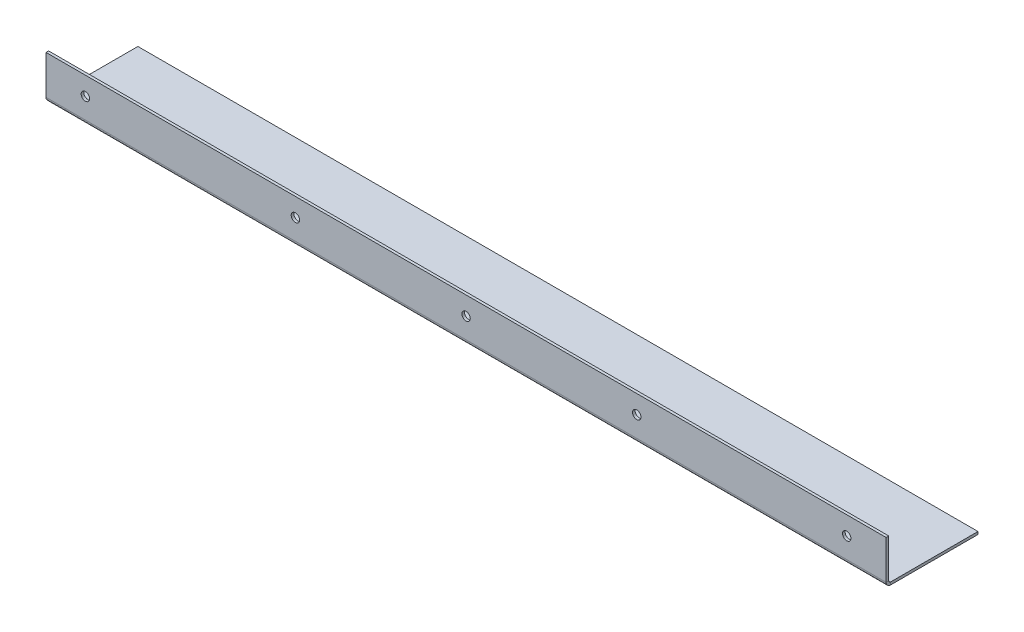
ISO-10303-21;
HEADER;
FILE_DESCRIPTION(('STEP AP214'),'2;1');
FILE_NAME('part.step','',(''),(''),'','','');
FILE_SCHEMA(('AUTOMOTIVE_DESIGN { 1 0 10303 214 1 1 1 1 }'));
ENDSEC;
DATA;
#1=APPLICATION_CONTEXT('core data for automotive mechanical design processes');
#2=APPLICATION_PROTOCOL_DEFINITION('international standard','automotive_design',2000,#1);
#3=PRODUCT_CONTEXT('',#1,'mechanical');
#4=PRODUCT('Part','Part','',(#3));
#5=PRODUCT_RELATED_PRODUCT_CATEGORY('part','',(#4));
#6=PRODUCT_DEFINITION_FORMATION('','',#4);
#7=PRODUCT_DEFINITION_CONTEXT('part definition',#1,'design');
#8=PRODUCT_DEFINITION('design','',#6,#7);
#9=PRODUCT_DEFINITION_SHAPE('','',#8);
#10=(LENGTH_UNIT() NAMED_UNIT(*) SI_UNIT(.MILLI.,.METRE.));
#11=(NAMED_UNIT(*) PLANE_ANGLE_UNIT() SI_UNIT($,.RADIAN.));
#12=(NAMED_UNIT(*) SI_UNIT($,.STERADIAN.) SOLID_ANGLE_UNIT());
#13=UNCERTAINTY_MEASURE_WITH_UNIT(LENGTH_MEASURE(1.E-05),#10,'distance_accuracy_value','');
#14=(GEOMETRIC_REPRESENTATION_CONTEXT(3) GLOBAL_UNCERTAINTY_ASSIGNED_CONTEXT((#13)) GLOBAL_UNIT_ASSIGNED_CONTEXT((#10,
#11,#12)) REPRESENTATION_CONTEXT('',''));
#15=CARTESIAN_POINT('',(0.,0.,0.));
#16=DIRECTION('',(0.,0.,1.));
#17=DIRECTION('',(1.,0.,0.));
#18=AXIS2_PLACEMENT_3D('',#15,#16,#17);
#19=CARTESIAN_POINT('',(160.,38.5307532622854,16.0000000000001));
#20=DIRECTION('',(0.,0.,-1.));
#21=DIRECTION('',(0.,1.,0.));
#22=AXIS2_PLACEMENT_3D('',#19,#20,#21);
#23=PLANE('',#22);
#24=CARTESIAN_POINT('',(65.,31.5307532622854,16.0000000000001));
#25=DIRECTION('',(0.,0.,-1.));
#26=DIRECTION('',(0.,1.,0.));
#27=AXIS2_PLACEMENT_3D('',#24,#25,#26);
#28=CIRCLE('',#27,1.60000000000001);
#29=CARTESIAN_POINT('',(65.,33.1307532622854,16.0000000000001));
#30=VERTEX_POINT('',#29);
#31=EDGE_CURVE('E142',#30,#30,#28,.T.);
#32=ORIENTED_EDGE('',*,*,#31,.F.);
#33=EDGE_LOOP('',(#32));
#34=FACE_BOUND('',#33,.T.);
#35=CARTESIAN_POINT('',(145.,31.5307532622854,16.0000000000001));
#36=DIRECTION('',(0.,0.,-1.));
#37=DIRECTION('',(0.,1.,0.));
#38=AXIS2_PLACEMENT_3D('',#35,#36,#37);
#39=CIRCLE('',#38,1.59999999999999);
#40=CARTESIAN_POINT('',(145.,33.1307532622854,16.0000000000001));
#41=VERTEX_POINT('',#40);
#42=EDGE_CURVE('E132',#41,#41,#39,.T.);
#43=ORIENTED_EDGE('',*,*,#42,.F.);
#44=EDGE_LOOP('',(#43));
#45=FACE_BOUND('',#44,.T.);
#46=CARTESIAN_POINT('',(-65.,31.5307532622854,16.0000000000001));
#47=DIRECTION('',(0.,0.,-1.));
#48=DIRECTION('',(0.,1.,0.));
#49=AXIS2_PLACEMENT_3D('',#46,#47,#48);
#50=CIRCLE('',#49,1.60000000000001);
#51=CARTESIAN_POINT('',(-65.,33.1307532622854,16.0000000000001));
#52=VERTEX_POINT('',#51);
#53=EDGE_CURVE('E129',#52,#52,#50,.T.);
#54=ORIENTED_EDGE('',*,*,#53,.F.);
#55=EDGE_LOOP('',(#54));
#56=FACE_BOUND('',#55,.T.);
#57=CARTESIAN_POINT('',(-145.,31.5307532622854,16.0000000000001));
#58=DIRECTION('',(0.,0.,-1.));
#59=DIRECTION('',(0.,1.,0.));
#60=AXIS2_PLACEMENT_3D('',#57,#58,#59);
#61=CIRCLE('',#60,1.59999999999999);
#62=CARTESIAN_POINT('',(-145.,33.1307532622854,16.0000000000001));
#63=VERTEX_POINT('',#62);
#64=EDGE_CURVE('E126',#63,#63,#61,.T.);
#65=ORIENTED_EDGE('',*,*,#64,.F.);
#66=EDGE_LOOP('',(#65));
#67=FACE_BOUND('',#66,.T.);
#68=CARTESIAN_POINT('',(0.,31.5307532622854,16.0000000000001));
#69=DIRECTION('',(0.,0.,-1.));
#70=DIRECTION('',(0.,1.,0.));
#71=AXIS2_PLACEMENT_3D('',#68,#69,#70);
#72=CIRCLE('',#71,1.6);
#73=CARTESIAN_POINT('',(0.,33.1307532622854,16.0000000000001));
#74=VERTEX_POINT('',#73);
#75=EDGE_CURVE('E122',#74,#74,#72,.T.);
#76=ORIENTED_EDGE('',*,*,#75,.F.);
#77=EDGE_LOOP('',(#76));
#78=FACE_BOUND('',#77,.T.);
#79=DIRECTION('',(0.,-1.,0.));
#80=VECTOR('',#79,1.);
#81=CARTESIAN_POINT('',(160.,38.5307532622854,16.0000000000001));
#82=LINE('',#81,#80);
#83=CARTESIAN_POINT('',(160.,38.5307532622854,16.0000000000001));
#84=VERTEX_POINT('',#83);
#85=CARTESIAN_POINT('',(160.,23.7366,16.0000000000002));
#86=VERTEX_POINT('',#85);
#87=EDGE_CURVE('E101',#84,#86,#82,.T.);
#88=ORIENTED_EDGE('',*,*,#87,.T.);
#89=DIRECTION('',(-1.,0.,0.));
#90=VECTOR('',#89,1.);
#91=CARTESIAN_POINT('',(160.,23.7366,16.0000000000002));
#92=LINE('',#91,#90);
#93=CARTESIAN_POINT('',(-160.,23.7366,16.0000000000002));
#94=VERTEX_POINT('',#93);
#95=EDGE_CURVE('E108',#86,#94,#92,.T.);
#96=ORIENTED_EDGE('',*,*,#95,.T.);
#97=DIRECTION('',(0.,-1.,0.));
#98=VECTOR('',#97,1.);
#99=CARTESIAN_POINT('',(-160.,38.5307532622854,16.0000000000001));
#100=LINE('',#99,#98);
#101=CARTESIAN_POINT('',(-160.,38.5307532622854,16.0000000000001));
#102=VERTEX_POINT('',#101);
#103=EDGE_CURVE('E95',#102,#94,#100,.T.);
#104=ORIENTED_EDGE('',*,*,#103,.F.);
#105=DIRECTION('',(-1.,0.,0.));
#106=VECTOR('',#105,1.);
#107=CARTESIAN_POINT('',(160.,38.5307532622854,16.0000000000001));
#108=LINE('',#107,#106);
#109=EDGE_CURVE('E88',#84,#102,#108,.T.);
#110=ORIENTED_EDGE('',*,*,#109,.F.);
#111=EDGE_LOOP('',(#88,#96,#104,#110));
#112=FACE_BOUND('',#111,.T.);
#113=ADVANCED_FACE('F42',(#34,#45,#56,#67,#78,#112),#23,.T.);
#114=CARTESIAN_POINT('',(-160.,6.53075326228535,39.0000000000002));
#115=DIRECTION('',(-1.,0.,0.));
#116=DIRECTION('',(0.,1.,0.));
#117=AXIS2_PLACEMENT_3D('',#114,#115,#116);
#118=PLANE('',#117);
#119=ORIENTED_EDGE('',*,*,#103,.T.);
#120=DIRECTION('',(0.,0.,1.));
#121=VECTOR('',#120,1.);
#122=CARTESIAN_POINT('',(-160.,23.7366000000001,39.0000000000001));
#123=LINE('',#122,#121);
#124=CARTESIAN_POINT('',(-160.,23.7366,17.0000000000002));
#125=VERTEX_POINT('',#124);
#126=EDGE_CURVE('E12',#94,#125,#123,.T.);
#127=ORIENTED_EDGE('',*,*,#126,.T.);
#128=DIRECTION('',(0.,-1.,0.));
#129=VECTOR('',#128,1.);
#130=CARTESIAN_POINT('',(-160.,38.5307532622854,17.0000000000001));
#131=LINE('',#130,#129);
#132=CARTESIAN_POINT('',(-160.,38.5307532622854,17.0000000000001));
#133=VERTEX_POINT('',#132);
#134=EDGE_CURVE('E84',#133,#125,#131,.T.);
#135=ORIENTED_EDGE('',*,*,#134,.F.);
#136=DIRECTION('',(0.,0.,-1.));
#137=VECTOR('',#136,1.);
#138=CARTESIAN_POINT('',(-160.,38.5307532622854,17.0000000000001));
#139=LINE('',#138,#137);
#140=EDGE_CURVE('E94',#133,#102,#139,.T.);
#141=ORIENTED_EDGE('',*,*,#140,.T.);
#142=EDGE_LOOP('',(#119,#127,#135,#141));
#143=FACE_BOUND('',#142,.T.);
#144=ADVANCED_FACE('F44',(#143),#118,.T.);
#145=CARTESIAN_POINT('',(160.,38.5307532622854,17.0000000000001));
#146=DIRECTION('',(0.,0.,-1.));
#147=DIRECTION('',(0.,1.,0.));
#148=AXIS2_PLACEMENT_3D('',#145,#146,#147);
#149=PLANE('',#148);
#150=CARTESIAN_POINT('',(65.,31.5307532622854,17.0000000000001));
#151=DIRECTION('',(0.,0.,-1.));
#152=DIRECTION('',(0.,1.,0.));
#153=AXIS2_PLACEMENT_3D('',#150,#151,#152);
#154=CIRCLE('',#153,1.60000000000001);
#155=CARTESIAN_POINT('',(65.,33.1307532622854,17.0000000000001));
#156=VERTEX_POINT('',#155);
#157=EDGE_CURVE('E46',#156,#156,#154,.T.);
#158=ORIENTED_EDGE('',*,*,#157,.T.);
#159=EDGE_LOOP('',(#158));
#160=FACE_BOUND('',#159,.T.);
#161=CARTESIAN_POINT('',(145.,31.5307532622854,17.0000000000001));
#162=DIRECTION('',(0.,0.,-1.));
#163=DIRECTION('',(0.,1.,0.));
#164=AXIS2_PLACEMENT_3D('',#161,#162,#163);
#165=CIRCLE('',#164,1.59999999999999);
#166=CARTESIAN_POINT('',(145.,33.1307532622854,17.0000000000001));
#167=VERTEX_POINT('',#166);
#168=EDGE_CURVE('E130',#167,#167,#165,.T.);
#169=ORIENTED_EDGE('',*,*,#168,.T.);
#170=EDGE_LOOP('',(#169));
#171=FACE_BOUND('',#170,.T.);
#172=CARTESIAN_POINT('',(-65.,31.5307532622854,17.0000000000001));
#173=DIRECTION('',(0.,0.,-1.));
#174=DIRECTION('',(0.,1.,0.));
#175=AXIS2_PLACEMENT_3D('',#172,#173,#174);
#176=CIRCLE('',#175,1.60000000000001);
#177=CARTESIAN_POINT('',(-65.,33.1307532622854,17.0000000000001));
#178=VERTEX_POINT('',#177);
#179=EDGE_CURVE('E127',#178,#178,#176,.T.);
#180=ORIENTED_EDGE('',*,*,#179,.T.);
#181=EDGE_LOOP('',(#180));
#182=FACE_BOUND('',#181,.T.);
#183=CARTESIAN_POINT('',(-145.,31.5307532622854,17.0000000000001));
#184=DIRECTION('',(0.,0.,-1.));
#185=DIRECTION('',(0.,1.,0.));
#186=AXIS2_PLACEMENT_3D('',#183,#184,#185);
#187=CIRCLE('',#186,1.59999999999999);
#188=CARTESIAN_POINT('',(-145.,33.1307532622854,17.0000000000001));
#189=VERTEX_POINT('',#188);
#190=EDGE_CURVE('E123',#189,#189,#187,.T.);
#191=ORIENTED_EDGE('',*,*,#190,.T.);
#192=EDGE_LOOP('',(#191));
#193=FACE_BOUND('',#192,.T.);
#194=CARTESIAN_POINT('',(0.,31.5307532622854,17.0000000000001));
#195=DIRECTION('',(0.,0.,-1.));
#196=DIRECTION('',(0.,1.,0.));
#197=AXIS2_PLACEMENT_3D('',#194,#195,#196);
#198=CIRCLE('',#197,1.6);
#199=CARTESIAN_POINT('',(0.,33.1307532622854,17.0000000000001));
#200=VERTEX_POINT('',#199);
#201=EDGE_CURVE('E118',#200,#200,#198,.T.);
#202=ORIENTED_EDGE('',*,*,#201,.T.);
#203=EDGE_LOOP('',(#202));
#204=FACE_BOUND('',#203,.T.);
#205=DIRECTION('',(-1.,0.,0.));
#206=VECTOR('',#205,1.);
#207=CARTESIAN_POINT('',(160.,23.7366,17.0000000000002));
#208=LINE('',#207,#206);
#209=CARTESIAN_POINT('',(160.,23.7366,17.0000000000002));
#210=VERTEX_POINT('',#209);
#211=EDGE_CURVE('E51',#210,#125,#208,.T.);
#212=ORIENTED_EDGE('',*,*,#211,.F.);
#213=DIRECTION('',(0.,-1.,0.));
#214=VECTOR('',#213,1.);
#215=CARTESIAN_POINT('',(160.,38.5307532622854,17.0000000000001));
#216=LINE('',#215,#214);
#217=CARTESIAN_POINT('',(160.,38.5307532622854,17.0000000000001));
#218=VERTEX_POINT('',#217);
#219=EDGE_CURVE('E86',#218,#210,#216,.T.);
#220=ORIENTED_EDGE('',*,*,#219,.F.);
#221=DIRECTION('',(-1.,0.,0.));
#222=VECTOR('',#221,1.);
#223=CARTESIAN_POINT('',(160.,38.5307532622854,17.0000000000001));
#224=LINE('',#223,#222);
#225=EDGE_CURVE('E68',#218,#133,#224,.T.);
#226=ORIENTED_EDGE('',*,*,#225,.T.);
#227=ORIENTED_EDGE('',*,*,#134,.T.);
#228=EDGE_LOOP('',(#212,#220,#226,#227));
#229=FACE_BOUND('',#228,.T.);
#230=ADVANCED_FACE('F82',(#160,#171,#182,#193,#204,#229),#149,.F.);
#231=CARTESIAN_POINT('',(160.,38.5307532622854,17.0000000000001));
#232=DIRECTION('',(0.,1.,0.));
#233=DIRECTION('',(1.,0.,0.));
#234=AXIS2_PLACEMENT_3D('',#231,#232,#233);
#235=PLANE('',#234);
#236=ORIENTED_EDGE('',*,*,#140,.F.);
#237=ORIENTED_EDGE('',*,*,#225,.F.);
#238=DIRECTION('',(0.,0.,-1.));
#239=VECTOR('',#238,1.);
#240=CARTESIAN_POINT('',(160.,38.5307532622854,17.0000000000001));
#241=LINE('',#240,#239);
#242=EDGE_CURVE('E89',#218,#84,#241,.T.);
#243=ORIENTED_EDGE('',*,*,#242,.T.);
#244=ORIENTED_EDGE('',*,*,#109,.T.);
#245=EDGE_LOOP('',(#236,#237,#243,#244));
#246=FACE_BOUND('',#245,.T.);
#247=ADVANCED_FACE('F98',(#246),#235,.T.);
#248=CARTESIAN_POINT('',(160.,6.53075326228535,39.0000000000002));
#249=DIRECTION('',(-1.,0.,0.));
#250=DIRECTION('',(0.,1.,0.));
#251=AXIS2_PLACEMENT_3D('',#248,#249,#250);
#252=PLANE('',#251);
#253=DIRECTION('',(0.,0.,1.));
#254=VECTOR('',#253,1.);
#255=CARTESIAN_POINT('',(160.,23.7366000000001,39.0000000000001));
#256=LINE('',#255,#254);
#257=EDGE_CURVE('E111',#86,#210,#256,.T.);
#258=ORIENTED_EDGE('',*,*,#257,.F.);
#259=ORIENTED_EDGE('',*,*,#87,.F.);
#260=ORIENTED_EDGE('',*,*,#242,.F.);
#261=ORIENTED_EDGE('',*,*,#219,.T.);
#262=EDGE_LOOP('',(#258,#259,#260,#261));
#263=FACE_BOUND('',#262,.T.);
#264=ADVANCED_FACE('F240',(#263),#252,.F.);
#265=CARTESIAN_POINT('',(160.,23.,-17.9999999999999));
#266=DIRECTION('',(0.,0.,-1.));
#267=DIRECTION('',(-1.,0.,0.));
#268=AXIS2_PLACEMENT_3D('',#265,#266,#267);
#269=PLANE('',#268);
#270=DIRECTION('',(0.,-1.,0.));
#271=VECTOR('',#270,1.);
#272=CARTESIAN_POINT('',(-160.,23.,-17.9999999999999));
#273=LINE('',#272,#271);
#274=CARTESIAN_POINT('',(-160.,23.,-17.9999999999999));
#275=VERTEX_POINT('',#274);
#276=CARTESIAN_POINT('',(-160.,22.,-17.9999999999999));
#277=VERTEX_POINT('',#276);
#278=EDGE_CURVE('E96',#275,#277,#273,.T.);
#279=ORIENTED_EDGE('',*,*,#278,.F.);
#280=DIRECTION('',(-1.,0.,0.));
#281=VECTOR('',#280,1.);
#282=CARTESIAN_POINT('',(160.,23.,-17.9999999999999));
#283=LINE('',#282,#281);
#284=CARTESIAN_POINT('',(160.,23.,-17.9999999999999));
#285=VERTEX_POINT('',#284);
#286=EDGE_CURVE('E176',#285,#275,#283,.T.);
#287=ORIENTED_EDGE('',*,*,#286,.F.);
#288=DIRECTION('',(0.,-1.,0.));
#289=VECTOR('',#288,1.);
#290=CARTESIAN_POINT('',(160.,23.,-17.9999999999999));
#291=LINE('',#290,#289);
#292=CARTESIAN_POINT('',(160.,22.,-17.9999999999999));
#293=VERTEX_POINT('',#292);
#294=EDGE_CURVE('E185',#285,#293,#291,.T.);
#295=ORIENTED_EDGE('',*,*,#294,.T.);
#296=DIRECTION('',(-1.,0.,0.));
#297=VECTOR('',#296,1.);
#298=CARTESIAN_POINT('',(160.,22.,-17.9999999999999));
#299=LINE('',#298,#297);
#300=EDGE_CURVE('E182',#293,#277,#299,.T.);
#301=ORIENTED_EDGE('',*,*,#300,.T.);
#302=EDGE_LOOP('',(#279,#287,#295,#301));
#303=FACE_BOUND('',#302,.T.);
#304=ADVANCED_FACE('F242',(#303),#269,.T.);
#305=CARTESIAN_POINT('',(160.,23.,32.0000000000002));
#306=DIRECTION('',(0.,1.,0.));
#307=DIRECTION('',(0.,0.,1.));
#308=AXIS2_PLACEMENT_3D('',#305,#306,#307);
#309=PLANE('',#308);
#310=DIRECTION('',(-1.,0.,0.));
#311=VECTOR('',#310,1.);
#312=CARTESIAN_POINT('',(160.,23.,15.2634000000002));
#313=LINE('',#312,#311);
#314=CARTESIAN_POINT('',(160.,23.,15.2634000000002));
#315=VERTEX_POINT('',#314);
#316=CARTESIAN_POINT('',(-160.,23.,15.2634000000002));
#317=VERTEX_POINT('',#316);
#318=EDGE_CURVE('E154',#315,#317,#313,.T.);
#319=ORIENTED_EDGE('',*,*,#318,.F.);
#320=DIRECTION('',(0.,0.,-1.));
#321=VECTOR('',#320,1.);
#322=CARTESIAN_POINT('',(160.,23.,32.0000000000002));
#323=LINE('',#322,#321);
#324=EDGE_CURVE('E179',#315,#285,#323,.T.);
#325=ORIENTED_EDGE('',*,*,#324,.T.);
#326=ORIENTED_EDGE('',*,*,#286,.T.);
#327=DIRECTION('',(0.,0.,-1.));
#328=VECTOR('',#327,1.);
#329=CARTESIAN_POINT('',(-160.,23.,32.0000000000002));
#330=LINE('',#329,#328);
#331=EDGE_CURVE('E161',#317,#275,#330,.T.);
#332=ORIENTED_EDGE('',*,*,#331,.F.);
#333=EDGE_LOOP('',(#319,#325,#326,#332));
#334=FACE_BOUND('',#333,.T.);
#335=ADVANCED_FACE('F205',(#334),#309,.T.);
#336=CARTESIAN_POINT('',(160.,0.,0.));
#337=DIRECTION('',(-1.,0.,0.));
#338=DIRECTION('',(0.,0.,1.));
#339=AXIS2_PLACEMENT_3D('',#336,#337,#338);
#340=PLANE('',#339);
#341=ORIENTED_EDGE('',*,*,#324,.F.);
#342=DIRECTION('',(0.,-1.,0.));
#343=VECTOR('',#342,1.);
#344=CARTESIAN_POINT('',(160.,0.,15.2634000000002));
#345=LINE('',#344,#343);
#346=CARTESIAN_POINT('',(160.,22.,15.2634000000002));
#347=VERTEX_POINT('',#346);
#348=EDGE_CURVE('E173',#315,#347,#345,.T.);
#349=ORIENTED_EDGE('',*,*,#348,.T.);
#350=DIRECTION('',(0.,0.,-1.));
#351=VECTOR('',#350,1.);
#352=CARTESIAN_POINT('',(160.,22.,32.0000000000002));
#353=LINE('',#352,#351);
#354=EDGE_CURVE('E170',#347,#293,#353,.T.);
#355=ORIENTED_EDGE('',*,*,#354,.T.);
#356=ORIENTED_EDGE('',*,*,#294,.F.);
#357=EDGE_LOOP('',(#341,#349,#355,#356));
#358=FACE_BOUND('',#357,.T.);
#359=ADVANCED_FACE('F264',(#358),#340,.F.);
#360=CARTESIAN_POINT('',(160.,22.,32.0000000000002));
#361=DIRECTION('',(0.,1.,0.));
#362=DIRECTION('',(0.,0.,1.));
#363=AXIS2_PLACEMENT_3D('',#360,#361,#362);
#364=PLANE('',#363);
#365=ORIENTED_EDGE('',*,*,#354,.F.);
#366=DIRECTION('',(-1.,0.,0.));
#367=VECTOR('',#366,1.);
#368=CARTESIAN_POINT('',(160.,22.,15.2634000000002));
#369=LINE('',#368,#367);
#370=CARTESIAN_POINT('',(-160.,22.,15.2634000000002));
#371=VERTEX_POINT('',#370);
#372=EDGE_CURVE('E167',#347,#371,#369,.T.);
#373=ORIENTED_EDGE('',*,*,#372,.T.);
#374=DIRECTION('',(0.,0.,-1.));
#375=VECTOR('',#374,1.);
#376=CARTESIAN_POINT('',(-160.,22.,32.0000000000002));
#377=LINE('',#376,#375);
#378=EDGE_CURVE('E164',#371,#277,#377,.T.);
#379=ORIENTED_EDGE('',*,*,#378,.T.);
#380=ORIENTED_EDGE('',*,*,#300,.F.);
#381=EDGE_LOOP('',(#365,#373,#379,#380));
#382=FACE_BOUND('',#381,.T.);
#383=ADVANCED_FACE('F219',(#382),#364,.F.);
#384=CARTESIAN_POINT('',(-160.,0.,0.));
#385=DIRECTION('',(-1.,0.,0.));
#386=DIRECTION('',(0.,0.,1.));
#387=AXIS2_PLACEMENT_3D('',#384,#385,#386);
#388=PLANE('',#387);
#389=DIRECTION('',(0.,-1.,0.));
#390=VECTOR('',#389,1.);
#391=CARTESIAN_POINT('',(-160.,0.,15.2634000000002));
#392=LINE('',#391,#390);
#393=EDGE_CURVE('E188',#317,#371,#392,.T.);
#394=ORIENTED_EDGE('',*,*,#393,.F.);
#395=ORIENTED_EDGE('',*,*,#331,.T.);
#396=ORIENTED_EDGE('',*,*,#278,.T.);
#397=ORIENTED_EDGE('',*,*,#378,.F.);
#398=EDGE_LOOP('',(#394,#395,#396,#397));
#399=FACE_BOUND('',#398,.T.);
#400=ADVANCED_FACE('F210',(#399),#388,.T.);
#401=CARTESIAN_POINT('',(160.,23.7366,15.2634000000002));
#402=DIRECTION('',(-1.,0.,0.));
#403=DIRECTION('',(0.,0.,1.));
#404=AXIS2_PLACEMENT_3D('',#401,#402,#403);
#405=PLANE('',#404);
#406=ORIENTED_EDGE('',*,*,#257,.T.);
#407=CARTESIAN_POINT('',(160.,23.7366,15.2634000000002));
#408=DIRECTION('',(1.,0.,0.));
#409=DIRECTION('',(0.,0.,-1.));
#410=AXIS2_PLACEMENT_3D('',#407,#408,#409);
#411=CIRCLE('',#410,1.7366);
#412=EDGE_CURVE('E121',#210,#347,#411,.T.);
#413=ORIENTED_EDGE('',*,*,#412,.T.);
#414=ORIENTED_EDGE('',*,*,#348,.F.);
#415=CARTESIAN_POINT('',(160.,23.7366,15.2634000000002));
#416=DIRECTION('',(1.,0.,0.));
#417=DIRECTION('',(0.,0.,-1.));
#418=AXIS2_PLACEMENT_3D('',#415,#416,#417);
#419=CIRCLE('',#418,0.7366);
#420=EDGE_CURVE('E149',#86,#315,#419,.T.);
#421=ORIENTED_EDGE('',*,*,#420,.F.);
#422=EDGE_LOOP('',(#406,#413,#414,#421));
#423=FACE_BOUND('',#422,.T.);
#424=ADVANCED_FACE('F236',(#423),#405,.F.);
#425=CARTESIAN_POINT('',(-160.,23.7366,15.2634000000002));
#426=DIRECTION('',(1.,0.,0.));
#427=DIRECTION('',(0.,0.,-1.));
#428=AXIS2_PLACEMENT_3D('',#425,#426,#427);
#429=PLANE('',#428);
#430=CARTESIAN_POINT('',(-160.,23.7366,15.2634000000002));
#431=DIRECTION('',(1.,0.,0.));
#432=DIRECTION('',(0.,0.,-1.));
#433=AXIS2_PLACEMENT_3D('',#430,#431,#432);
#434=CIRCLE('',#433,1.7366);
#435=EDGE_CURVE('E152',#371,#125,#434,.F.);
#436=ORIENTED_EDGE('',*,*,#435,.T.);
#437=ORIENTED_EDGE('',*,*,#126,.F.);
#438=CARTESIAN_POINT('',(-160.,23.7366,15.2634000000002));
#439=DIRECTION('',(-1.,0.,0.));
#440=DIRECTION('',(0.,0.,-1.));
#441=AXIS2_PLACEMENT_3D('',#438,#439,#440);
#442=CIRCLE('',#441,0.7366);
#443=EDGE_CURVE('E59',#317,#94,#442,.T.);
#444=ORIENTED_EDGE('',*,*,#443,.F.);
#445=ORIENTED_EDGE('',*,*,#393,.T.);
#446=EDGE_LOOP('',(#436,#437,#444,#445));
#447=FACE_BOUND('',#446,.T.);
#448=ADVANCED_FACE('F201',(#447),#429,.F.);
#449=CARTESIAN_POINT('',(-320.007457880795,23.7366,15.2634000000002));
#450=DIRECTION('',(1.,0.,0.));
#451=DIRECTION('',(0.,0.,-1.));
#452=AXIS2_PLACEMENT_3D('',#449,#450,#451);
#453=CYLINDRICAL_SURFACE('',#452,0.7366);
#454=ORIENTED_EDGE('',*,*,#318,.T.);
#455=ORIENTED_EDGE('',*,*,#443,.T.);
#456=ORIENTED_EDGE('',*,*,#95,.F.);
#457=ORIENTED_EDGE('',*,*,#420,.T.);
#458=EDGE_LOOP('',(#454,#455,#456,#457));
#459=FACE_BOUND('',#458,.T.);
#460=ADVANCED_FACE('F192',(#459),#453,.F.);
#461=CARTESIAN_POINT('',(-320.007457880795,23.7366,15.2634000000002));
#462=DIRECTION('',(1.,0.,0.));
#463=DIRECTION('',(0.,0.,-1.));
#464=AXIS2_PLACEMENT_3D('',#461,#462,#463);
#465=CYLINDRICAL_SURFACE('',#464,1.7366);
#466=ORIENTED_EDGE('',*,*,#372,.F.);
#467=ORIENTED_EDGE('',*,*,#412,.F.);
#468=ORIENTED_EDGE('',*,*,#211,.T.);
#469=ORIENTED_EDGE('',*,*,#435,.F.);
#470=EDGE_LOOP('',(#466,#467,#468,#469));
#471=FACE_BOUND('',#470,.T.);
#472=ADVANCED_FACE('F222',(#471),#465,.T.);
#473=CARTESIAN_POINT('',(0.,31.5307532622854,18.0000000000001));
#474=DIRECTION('',(0.,0.,-1.));
#475=DIRECTION('',(0.,1.,0.));
#476=AXIS2_PLACEMENT_3D('',#473,#474,#475);
#477=CYLINDRICAL_SURFACE('',#476,1.6);
#478=ORIENTED_EDGE('',*,*,#75,.T.);
#479=EDGE_LOOP('',(#478));
#480=FACE_BOUND('',#479,.T.);
#481=ORIENTED_EDGE('',*,*,#201,.F.);
#482=EDGE_LOOP('',(#481));
#483=FACE_BOUND('',#482,.T.);
#484=ADVANCED_FACE('F276',(#480,#483),#477,.F.);
#485=CARTESIAN_POINT('',(-145.,31.5307532622854,18.0000000000001));
#486=DIRECTION('',(0.,0.,-1.));
#487=DIRECTION('',(0.,1.,0.));
#488=AXIS2_PLACEMENT_3D('',#485,#486,#487);
#489=CYLINDRICAL_SURFACE('',#488,1.59999999999999);
#490=ORIENTED_EDGE('',*,*,#64,.T.);
#491=EDGE_LOOP('',(#490));
#492=FACE_BOUND('',#491,.T.);
#493=ORIENTED_EDGE('',*,*,#190,.F.);
#494=EDGE_LOOP('',(#493));
#495=FACE_BOUND('',#494,.T.);
#496=ADVANCED_FACE('F281',(#492,#495),#489,.F.);
#497=CARTESIAN_POINT('',(-65.,31.5307532622854,18.0000000000001));
#498=DIRECTION('',(0.,0.,-1.));
#499=DIRECTION('',(0.,1.,0.));
#500=AXIS2_PLACEMENT_3D('',#497,#498,#499);
#501=CYLINDRICAL_SURFACE('',#500,1.60000000000001);
#502=ORIENTED_EDGE('',*,*,#53,.T.);
#503=EDGE_LOOP('',(#502));
#504=FACE_BOUND('',#503,.T.);
#505=ORIENTED_EDGE('',*,*,#179,.F.);
#506=EDGE_LOOP('',(#505));
#507=FACE_BOUND('',#506,.T.);
#508=ADVANCED_FACE('F285',(#504,#507),#501,.F.);
#509=CARTESIAN_POINT('',(145.,31.5307532622854,18.0000000000001));
#510=DIRECTION('',(0.,0.,-1.));
#511=DIRECTION('',(0.,1.,0.));
#512=AXIS2_PLACEMENT_3D('',#509,#510,#511);
#513=CYLINDRICAL_SURFACE('',#512,1.59999999999999);
#514=ORIENTED_EDGE('',*,*,#42,.T.);
#515=EDGE_LOOP('',(#514));
#516=FACE_BOUND('',#515,.T.);
#517=ORIENTED_EDGE('',*,*,#168,.F.);
#518=EDGE_LOOP('',(#517));
#519=FACE_BOUND('',#518,.T.);
#520=ADVANCED_FACE('F289',(#516,#519),#513,.F.);
#521=CARTESIAN_POINT('',(65.,31.5307532622854,18.0000000000001));
#522=DIRECTION('',(0.,0.,-1.));
#523=DIRECTION('',(0.,1.,0.));
#524=AXIS2_PLACEMENT_3D('',#521,#522,#523);
#525=CYLINDRICAL_SURFACE('',#524,1.60000000000001);
#526=ORIENTED_EDGE('',*,*,#31,.T.);
#527=EDGE_LOOP('',(#526));
#528=FACE_BOUND('',#527,.T.);
#529=ORIENTED_EDGE('',*,*,#157,.F.);
#530=EDGE_LOOP('',(#529));
#531=FACE_BOUND('',#530,.T.);
#532=ADVANCED_FACE('F293',(#528,#531),#525,.F.);
#533=CLOSED_SHELL('',(#113,#144,#230,#247,#264,#304,#335,#359,#383,#400,#424,#448,#460,#472,
#484,#496,#508,#520,#532));
#534=MANIFOLD_SOLID_BREP('B2',#533);
#535=ADVANCED_BREP_SHAPE_REPRESENTATION('',(#18,#534),#14);
#536=SHAPE_DEFINITION_REPRESENTATION(#9,#535);
ENDSEC;
END-ISO-10303-21;
